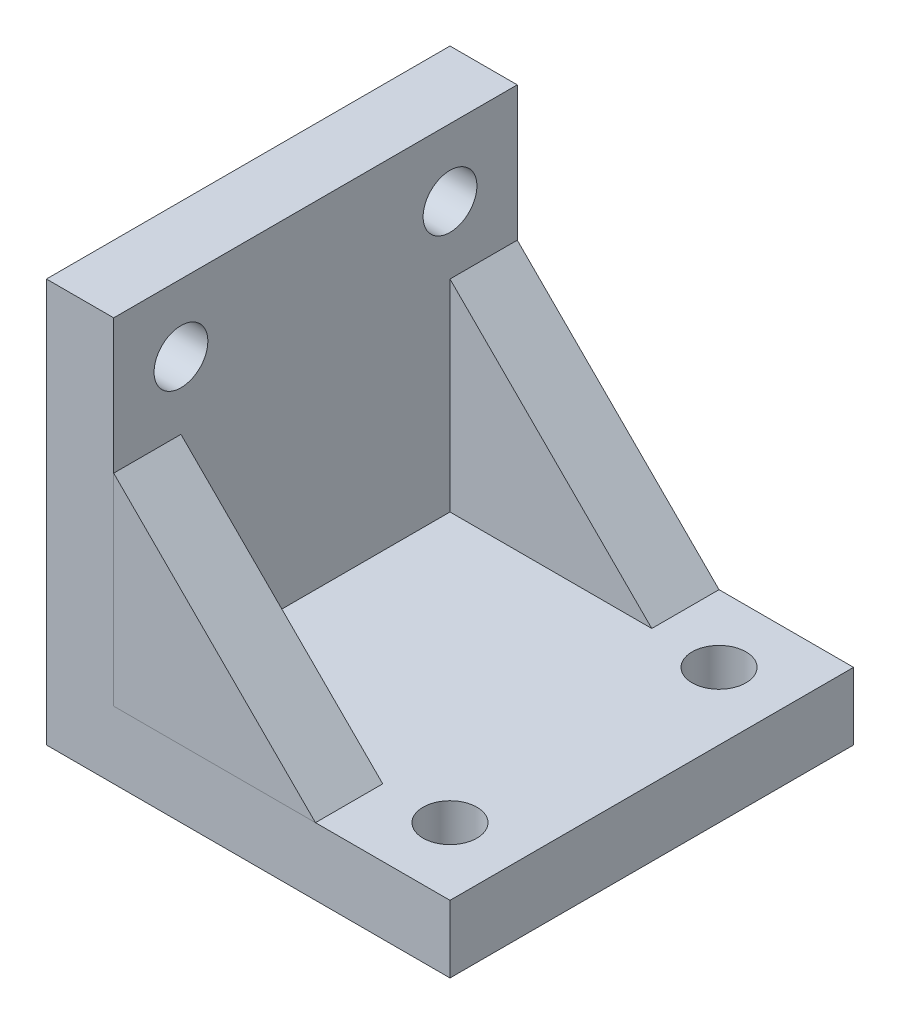
ISO-10303-21;
HEADER;
FILE_DESCRIPTION(('STEP AP214'),'2;1');
FILE_NAME('part.step','',(''),(''),'','','');
FILE_SCHEMA(('AUTOMOTIVE_DESIGN { 1 0 10303 214 1 1 1 1 }'));
ENDSEC;
DATA;
#1=APPLICATION_CONTEXT('core data for automotive mechanical design processes');
#2=APPLICATION_PROTOCOL_DEFINITION('international standard','automotive_design',2000,#1);
#3=PRODUCT_CONTEXT('',#1,'mechanical');
#4=PRODUCT('Part','Part','',(#3));
#5=PRODUCT_RELATED_PRODUCT_CATEGORY('part','',(#4));
#6=PRODUCT_DEFINITION_FORMATION('','',#4);
#7=PRODUCT_DEFINITION_CONTEXT('part definition',#1,'design');
#8=PRODUCT_DEFINITION('design','',#6,#7);
#9=PRODUCT_DEFINITION_SHAPE('','',#8);
#10=(LENGTH_UNIT() NAMED_UNIT(*) SI_UNIT(.MILLI.,.METRE.));
#11=(NAMED_UNIT(*) PLANE_ANGLE_UNIT() SI_UNIT($,.RADIAN.));
#12=(NAMED_UNIT(*) SI_UNIT($,.STERADIAN.) SOLID_ANGLE_UNIT());
#13=UNCERTAINTY_MEASURE_WITH_UNIT(LENGTH_MEASURE(1.E-05),#10,'distance_accuracy_value','');
#14=(GEOMETRIC_REPRESENTATION_CONTEXT(3) GLOBAL_UNCERTAINTY_ASSIGNED_CONTEXT((#13)) GLOBAL_UNIT_ASSIGNED_CONTEXT((#10,
#11,#12)) REPRESENTATION_CONTEXT('',''));
#15=CARTESIAN_POINT('',(0.,0.,0.));
#16=DIRECTION('',(0.,0.,1.));
#17=DIRECTION('',(1.,0.,0.));
#18=AXIS2_PLACEMENT_3D('',#15,#16,#17);
#19=CARTESIAN_POINT('',(5.00000000000001,5.,10.));
#20=DIRECTION('',(0.,-1.,0.));
#21=DIRECTION('',(0.,0.,-1.));
#22=AXIS2_PLACEMENT_3D('',#19,#20,#21);
#23=PLANE('',#22);
#24=DIRECTION('',(1.,0.,0.));
#25=VECTOR('',#24,1.);
#26=CARTESIAN_POINT('',(5.00000000000001,5.,15.));
#27=LINE('',#26,#25);
#28=CARTESIAN_POINT('',(-9.99999999999999,5.,15.));
#29=VERTEX_POINT('',#28);
#30=CARTESIAN_POINT('',(5.00000000000001,5.,15.));
#31=VERTEX_POINT('',#30);
#32=EDGE_CURVE('E94',#29,#31,#27,.T.);
#33=ORIENTED_EDGE('',*,*,#32,.F.);
#34=DIRECTION('',(0.,0.,1.));
#35=VECTOR('',#34,1.);
#36=CARTESIAN_POINT('',(-9.99999999999999,5.,10.));
#37=LINE('',#36,#35);
#38=CARTESIAN_POINT('',(-9.99999999999999,5.,10.));
#39=VERTEX_POINT('',#38);
#40=EDGE_CURVE('E12',#39,#29,#37,.T.);
#41=ORIENTED_EDGE('',*,*,#40,.F.);
#42=DIRECTION('',(1.,0.,0.));
#43=VECTOR('',#42,1.);
#44=CARTESIAN_POINT('',(5.00000000000001,5.,10.));
#45=LINE('',#44,#43);
#46=CARTESIAN_POINT('',(5.00000000000001,5.,10.));
#47=VERTEX_POINT('',#46);
#48=EDGE_CURVE('E86',#39,#47,#45,.T.);
#49=ORIENTED_EDGE('',*,*,#48,.T.);
#50=DIRECTION('',(0.,0.,1.));
#51=VECTOR('',#50,1.);
#52=CARTESIAN_POINT('',(5.00000000000001,5.,10.));
#53=LINE('',#52,#51);
#54=EDGE_CURVE('E45',#47,#31,#53,.T.);
#55=ORIENTED_EDGE('',*,*,#54,.T.);
#56=EDGE_LOOP('',(#33,#41,#49,#55));
#57=FACE_BOUND('',#56,.T.);
#58=ADVANCED_FACE('F42',(#57),#23,.T.);
#59=CARTESIAN_POINT('',(-9.99999999999999,5.,10.));
#60=DIRECTION('',(-1.,0.,0.));
#61=DIRECTION('',(0.,-1.,0.));
#62=AXIS2_PLACEMENT_3D('',#59,#60,#61);
#63=PLANE('',#62);
#64=DIRECTION('',(0.,-1.,0.));
#65=VECTOR('',#64,1.);
#66=CARTESIAN_POINT('',(-9.99999999999999,5.,15.));
#67=LINE('',#66,#65);
#68=CARTESIAN_POINT('',(-9.99999999999999,20.,15.));
#69=VERTEX_POINT('',#68);
#70=EDGE_CURVE('E88',#69,#29,#67,.T.);
#71=ORIENTED_EDGE('',*,*,#70,.F.);
#72=DIRECTION('',(0.,0.,1.));
#73=VECTOR('',#72,1.);
#74=CARTESIAN_POINT('',(-9.99999999999999,20.,10.));
#75=LINE('',#74,#73);
#76=CARTESIAN_POINT('',(-9.99999999999999,20.,10.));
#77=VERTEX_POINT('',#76);
#78=EDGE_CURVE('E51',#77,#69,#75,.T.);
#79=ORIENTED_EDGE('',*,*,#78,.F.);
#80=DIRECTION('',(0.,-1.,0.));
#81=VECTOR('',#80,1.);
#82=CARTESIAN_POINT('',(-9.99999999999999,5.,10.));
#83=LINE('',#82,#81);
#84=EDGE_CURVE('E83',#77,#39,#83,.T.);
#85=ORIENTED_EDGE('',*,*,#84,.T.);
#86=ORIENTED_EDGE('',*,*,#40,.T.);
#87=EDGE_LOOP('',(#71,#79,#85,#86));
#88=FACE_BOUND('',#87,.T.);
#89=ADVANCED_FACE('F98',(#88),#63,.T.);
#90=CARTESIAN_POINT('',(-9.99999999999999,20.,10.));
#91=DIRECTION('',(0.707106781186548,0.707106781186548,0.));
#92=DIRECTION('',(-0.707106781186548,0.707106781186548,0.));
#93=AXIS2_PLACEMENT_3D('',#90,#91,#92);
#94=PLANE('',#93);
#95=DIRECTION('',(-0.707106781186547,0.707106781186547,0.));
#96=VECTOR('',#95,1.);
#97=CARTESIAN_POINT('',(-9.99999999999999,20.,15.));
#98=LINE('',#97,#96);
#99=EDGE_CURVE('E81',#31,#69,#98,.T.);
#100=ORIENTED_EDGE('',*,*,#99,.F.);
#101=ORIENTED_EDGE('',*,*,#54,.F.);
#102=DIRECTION('',(-0.707106781186547,0.707106781186547,0.));
#103=VECTOR('',#102,1.);
#104=CARTESIAN_POINT('',(-9.99999999999999,20.,10.));
#105=LINE('',#104,#103);
#106=EDGE_CURVE('E79',#47,#77,#105,.T.);
#107=ORIENTED_EDGE('',*,*,#106,.T.);
#108=ORIENTED_EDGE('',*,*,#78,.T.);
#109=EDGE_LOOP('',(#100,#101,#107,#108));
#110=FACE_BOUND('',#109,.T.);
#111=ADVANCED_FACE('F78',(#110),#94,.T.);
#112=CARTESIAN_POINT('',(0.,0.,10.));
#113=DIRECTION('',(0.,0.,-1.));
#114=DIRECTION('',(-1.,0.,0.));
#115=AXIS2_PLACEMENT_3D('',#112,#113,#114);
#116=PLANE('',#115);
#117=ORIENTED_EDGE('',*,*,#48,.F.);
#118=ORIENTED_EDGE('',*,*,#84,.F.);
#119=ORIENTED_EDGE('',*,*,#106,.F.);
#120=EDGE_LOOP('',(#117,#118,#119));
#121=FACE_BOUND('',#120,.T.);
#122=ADVANCED_FACE('F85',(#121),#116,.T.);
#123=CARTESIAN_POINT('',(0.,0.,15.));
#124=DIRECTION('',(0.,0.,-1.));
#125=DIRECTION('',(-1.,0.,0.));
#126=AXIS2_PLACEMENT_3D('',#123,#124,#125);
#127=PLANE('',#126);
#128=ORIENTED_EDGE('',*,*,#32,.T.);
#129=ORIENTED_EDGE('',*,*,#99,.T.);
#130=ORIENTED_EDGE('',*,*,#70,.T.);
#131=EDGE_LOOP('',(#128,#129,#130));
#132=FACE_BOUND('',#131,.T.);
#133=ADVANCED_FACE('F97',(#132),#127,.F.);
#134=CLOSED_SHELL('',(#58,#89,#111,#122,#133));
#135=MANIFOLD_SOLID_BREP('B2',#134);
#136=CARTESIAN_POINT('',(0.,5.,0.));
#137=DIRECTION('',(0.,-1.,0.));
#138=DIRECTION('',(0.,0.,-1.));
#139=AXIS2_PLACEMENT_3D('',#136,#137,#138);
#140=PLANE('',#139);
#141=CARTESIAN_POINT('',(10.,5.,10.));
#142=DIRECTION('',(0.,1.,0.));
#143=DIRECTION('',(0.,0.,1.));
#144=AXIS2_PLACEMENT_3D('',#141,#142,#143);
#145=CIRCLE('',#144,2.);
#146=CARTESIAN_POINT('',(10.,5.,12.));
#147=VERTEX_POINT('',#146);
#148=EDGE_CURVE('E306',#147,#147,#145,.T.);
#149=ORIENTED_EDGE('',*,*,#148,.F.);
#150=EDGE_LOOP('',(#149));
#151=FACE_BOUND('',#150,.T.);
#152=CARTESIAN_POINT('',(10.,5.,-10.));
#153=DIRECTION('',(0.,1.,0.));
#154=DIRECTION('',(0.,0.,1.));
#155=AXIS2_PLACEMENT_3D('',#152,#153,#154);
#156=CIRCLE('',#155,2.);
#157=CARTESIAN_POINT('',(10.,5.,-8.));
#158=VERTEX_POINT('',#157);
#159=EDGE_CURVE('E300',#158,#158,#156,.T.);
#160=ORIENTED_EDGE('',*,*,#159,.F.);
#161=EDGE_LOOP('',(#160));
#162=FACE_BOUND('',#161,.T.);
#163=DIRECTION('',(0.,0.,-1.));
#164=VECTOR('',#163,1.);
#165=CARTESIAN_POINT('',(5.00000000000001,5.,-10.));
#166=LINE('',#165,#164);
#167=CARTESIAN_POINT('',(5.00000000000001,5.,-10.));
#168=VERTEX_POINT('',#167);
#169=CARTESIAN_POINT('',(5.00000000000001,5.,-15.));
#170=VERTEX_POINT('',#169);
#171=EDGE_CURVE('E239',#168,#170,#166,.T.);
#172=ORIENTED_EDGE('',*,*,#171,.F.);
#173=DIRECTION('',(1.,0.,0.));
#174=VECTOR('',#173,1.);
#175=CARTESIAN_POINT('',(5.00000000000001,5.,-10.));
#176=LINE('',#175,#174);
#177=CARTESIAN_POINT('',(-9.99999999999999,5.,-10.));
#178=VERTEX_POINT('',#177);
#179=EDGE_CURVE('E254',#178,#168,#176,.T.);
#180=ORIENTED_EDGE('',*,*,#179,.F.);
#181=DIRECTION('',(0.,0.,-1.));
#182=VECTOR('',#181,1.);
#183=CARTESIAN_POINT('',(-9.99999999999999,5.,-15.));
#184=LINE('',#183,#182);
#185=CARTESIAN_POINT('',(-9.99999999999999,5.,15.));
#186=VERTEX_POINT('',#185);
#187=EDGE_CURVE('E154',#186,#178,#184,.T.);
#188=ORIENTED_EDGE('',*,*,#187,.F.);
#189=DIRECTION('',(1.,0.,0.));
#190=VECTOR('',#189,1.);
#191=CARTESIAN_POINT('',(-15.,5.,15.));
#192=LINE('',#191,#190);
#193=CARTESIAN_POINT('',(15.,5.,15.));
#194=VERTEX_POINT('',#193);
#195=EDGE_CURVE('E159',#186,#194,#192,.T.);
#196=ORIENTED_EDGE('',*,*,#195,.T.);
#197=DIRECTION('',(0.,0.,-1.));
#198=VECTOR('',#197,1.);
#199=CARTESIAN_POINT('',(15.,5.,15.));
#200=LINE('',#199,#198);
#201=CARTESIAN_POINT('',(15.,5.,-15.));
#202=VERTEX_POINT('',#201);
#203=EDGE_CURVE('E190',#194,#202,#200,.T.);
#204=ORIENTED_EDGE('',*,*,#203,.T.);
#205=DIRECTION('',(-1.,0.,0.));
#206=VECTOR('',#205,1.);
#207=CARTESIAN_POINT('',(-15.,5.,-15.));
#208=LINE('',#207,#206);
#209=EDGE_CURVE('E241',#202,#170,#208,.T.);
#210=ORIENTED_EDGE('',*,*,#209,.T.);
#211=EDGE_LOOP('',(#172,#180,#188,#196,#204,#210));
#212=FACE_BOUND('',#211,.T.);
#213=ADVANCED_FACE('F139',(#151,#162,#212),#140,.F.);
#214=CARTESIAN_POINT('',(-9.99999999999999,30.,-15.));
#215=DIRECTION('',(-1.,0.,0.));
#216=DIRECTION('',(0.,0.,1.));
#217=AXIS2_PLACEMENT_3D('',#214,#215,#216);
#218=PLANE('',#217);
#219=CARTESIAN_POINT('',(-9.99999999999999,25.,-10.));
#220=DIRECTION('',(1.,0.,0.));
#221=DIRECTION('',(0.,0.,-1.));
#222=AXIS2_PLACEMENT_3D('',#219,#220,#221);
#223=CIRCLE('',#222,2.);
#224=CARTESIAN_POINT('',(-9.99999999999999,25.,-12.));
#225=VERTEX_POINT('',#224);
#226=EDGE_CURVE('E294',#225,#225,#223,.T.);
#227=ORIENTED_EDGE('',*,*,#226,.F.);
#228=EDGE_LOOP('',(#227));
#229=FACE_BOUND('',#228,.T.);
#230=CARTESIAN_POINT('',(-9.99999999999999,25.,10.));
#231=DIRECTION('',(1.,0.,0.));
#232=DIRECTION('',(0.,0.,-1.));
#233=AXIS2_PLACEMENT_3D('',#230,#231,#232);
#234=CIRCLE('',#233,2.);
#235=CARTESIAN_POINT('',(-9.99999999999999,25.,8.));
#236=VERTEX_POINT('',#235);
#237=EDGE_CURVE('E288',#236,#236,#234,.T.);
#238=ORIENTED_EDGE('',*,*,#237,.F.);
#239=EDGE_LOOP('',(#238));
#240=FACE_BOUND('',#239,.T.);
#241=DIRECTION('',(0.,0.,-1.));
#242=VECTOR('',#241,1.);
#243=CARTESIAN_POINT('',(-9.99999999999999,20.,-10.));
#244=LINE('',#243,#242);
#245=CARTESIAN_POINT('',(-9.99999999999999,20.,-10.));
#246=VERTEX_POINT('',#245);
#247=CARTESIAN_POINT('',(-9.99999999999999,20.,-15.));
#248=VERTEX_POINT('',#247);
#249=EDGE_CURVE('E262',#246,#248,#244,.T.);
#250=ORIENTED_EDGE('',*,*,#249,.T.);
#251=DIRECTION('',(0.,-1.,0.));
#252=VECTOR('',#251,1.);
#253=CARTESIAN_POINT('',(-9.99999999999999,30.,-15.));
#254=LINE('',#253,#252);
#255=CARTESIAN_POINT('',(-9.99999999999999,30.,-15.));
#256=VERTEX_POINT('',#255);
#257=EDGE_CURVE('E204',#256,#248,#254,.T.);
#258=ORIENTED_EDGE('',*,*,#257,.F.);
#259=DIRECTION('',(0.,0.,-1.));
#260=VECTOR('',#259,1.);
#261=CARTESIAN_POINT('',(-9.99999999999999,30.,-15.));
#262=LINE('',#261,#260);
#263=CARTESIAN_POINT('',(-9.99999999999999,30.,15.));
#264=VERTEX_POINT('',#263);
#265=EDGE_CURVE('E231',#264,#256,#262,.T.);
#266=ORIENTED_EDGE('',*,*,#265,.F.);
#267=DIRECTION('',(0.,-1.,0.));
#268=VECTOR('',#267,1.);
#269=CARTESIAN_POINT('',(-9.99999999999999,30.,15.));
#270=LINE('',#269,#268);
#271=EDGE_CURVE('E200',#264,#186,#270,.T.);
#272=ORIENTED_EDGE('',*,*,#271,.T.);
#273=ORIENTED_EDGE('',*,*,#187,.T.);
#274=DIRECTION('',(0.,-1.,0.));
#275=VECTOR('',#274,1.);
#276=CARTESIAN_POINT('',(-9.99999999999999,5.,-10.));
#277=LINE('',#276,#275);
#278=EDGE_CURVE('E264',#246,#178,#277,.T.);
#279=ORIENTED_EDGE('',*,*,#278,.F.);
#280=EDGE_LOOP('',(#250,#258,#266,#272,#273,#279));
#281=FACE_BOUND('',#280,.T.);
#282=ADVANCED_FACE('F271',(#229,#240,#281),#218,.F.);
#283=CARTESIAN_POINT('',(15.,5.,15.));
#284=DIRECTION('',(-1.,0.,0.));
#285=DIRECTION('',(0.,0.,1.));
#286=AXIS2_PLACEMENT_3D('',#283,#284,#285);
#287=PLANE('',#286);
#288=DIRECTION('',(0.,0.,-1.));
#289=VECTOR('',#288,1.);
#290=CARTESIAN_POINT('',(15.,0.,15.));
#291=LINE('',#290,#289);
#292=CARTESIAN_POINT('',(15.,0.,15.));
#293=VERTEX_POINT('',#292);
#294=CARTESIAN_POINT('',(15.,0.,-15.));
#295=VERTEX_POINT('',#294);
#296=EDGE_CURVE('E196',#293,#295,#291,.T.);
#297=ORIENTED_EDGE('',*,*,#296,.T.);
#298=DIRECTION('',(0.,-1.,0.));
#299=VECTOR('',#298,1.);
#300=CARTESIAN_POINT('',(15.,5.,-15.));
#301=LINE('',#300,#299);
#302=EDGE_CURVE('E40',#202,#295,#301,.T.);
#303=ORIENTED_EDGE('',*,*,#302,.F.);
#304=ORIENTED_EDGE('',*,*,#203,.F.);
#305=DIRECTION('',(0.,-1.,0.));
#306=VECTOR('',#305,1.);
#307=CARTESIAN_POINT('',(15.,5.,15.));
#308=LINE('',#307,#306);
#309=EDGE_CURVE('E182',#194,#293,#308,.T.);
#310=ORIENTED_EDGE('',*,*,#309,.T.);
#311=EDGE_LOOP('',(#297,#303,#304,#310));
#312=FACE_BOUND('',#311,.T.);
#313=ADVANCED_FACE('F141',(#312),#287,.F.);
#314=CARTESIAN_POINT('',(-15.,5.,-15.));
#315=DIRECTION('',(0.,0.,1.));
#316=DIRECTION('',(1.,0.,0.));
#317=AXIS2_PLACEMENT_3D('',#314,#315,#316);
#318=PLANE('',#317);
#319=DIRECTION('',(-0.707106781186547,0.707106781186547,0.));
#320=VECTOR('',#319,1.);
#321=CARTESIAN_POINT('',(-9.99999999999999,20.,-15.));
#322=LINE('',#321,#320);
#323=EDGE_CURVE('E250',#170,#248,#322,.T.);
#324=ORIENTED_EDGE('',*,*,#323,.F.);
#325=ORIENTED_EDGE('',*,*,#209,.F.);
#326=ORIENTED_EDGE('',*,*,#302,.T.);
#327=DIRECTION('',(-1.,0.,0.));
#328=VECTOR('',#327,1.);
#329=CARTESIAN_POINT('',(-15.,0.,-15.));
#330=LINE('',#329,#328);
#331=CARTESIAN_POINT('',(-15.,0.,-15.));
#332=VERTEX_POINT('',#331);
#333=EDGE_CURVE('E199',#295,#332,#330,.T.);
#334=ORIENTED_EDGE('',*,*,#333,.T.);
#335=DIRECTION('',(0.,-1.,0.));
#336=VECTOR('',#335,1.);
#337=CARTESIAN_POINT('',(-15.,5.,-15.));
#338=LINE('',#337,#336);
#339=CARTESIAN_POINT('',(-15.,30.,-15.));
#340=VERTEX_POINT('',#339);
#341=EDGE_CURVE('E147',#340,#332,#338,.T.);
#342=ORIENTED_EDGE('',*,*,#341,.F.);
#343=DIRECTION('',(-1.,0.,0.));
#344=VECTOR('',#343,1.);
#345=CARTESIAN_POINT('',(-15.,30.,-15.));
#346=LINE('',#345,#344);
#347=EDGE_CURVE('E224',#256,#340,#346,.T.);
#348=ORIENTED_EDGE('',*,*,#347,.F.);
#349=ORIENTED_EDGE('',*,*,#257,.T.);
#350=EDGE_LOOP('',(#324,#325,#326,#334,#342,#348,#349));
#351=FACE_BOUND('',#350,.T.);
#352=ADVANCED_FACE('F221',(#351),#318,.F.);
#353=CARTESIAN_POINT('',(-15.,5.,15.));
#354=DIRECTION('',(1.,0.,0.));
#355=DIRECTION('',(0.,0.,-1.));
#356=AXIS2_PLACEMENT_3D('',#353,#354,#355);
#357=PLANE('',#356);
#358=CARTESIAN_POINT('',(-15.,25.,-10.));
#359=DIRECTION('',(1.,0.,0.));
#360=DIRECTION('',(0.,0.,-1.));
#361=AXIS2_PLACEMENT_3D('',#358,#359,#360);
#362=CIRCLE('',#361,2.);
#363=CARTESIAN_POINT('',(-15.,25.,-12.));
#364=VERTEX_POINT('',#363);
#365=EDGE_CURVE('E291',#364,#364,#362,.T.);
#366=ORIENTED_EDGE('',*,*,#365,.T.);
#367=EDGE_LOOP('',(#366));
#368=FACE_BOUND('',#367,.T.);
#369=CARTESIAN_POINT('',(-15.,25.,10.));
#370=DIRECTION('',(1.,0.,0.));
#371=DIRECTION('',(0.,0.,-1.));
#372=AXIS2_PLACEMENT_3D('',#369,#370,#371);
#373=CIRCLE('',#372,2.);
#374=CARTESIAN_POINT('',(-15.,25.,8.));
#375=VERTEX_POINT('',#374);
#376=EDGE_CURVE('E255',#375,#375,#373,.T.);
#377=ORIENTED_EDGE('',*,*,#376,.T.);
#378=EDGE_LOOP('',(#377));
#379=FACE_BOUND('',#378,.T.);
#380=DIRECTION('',(0.,0.,1.));
#381=VECTOR('',#380,1.);
#382=CARTESIAN_POINT('',(-15.,0.,15.));
#383=LINE('',#382,#381);
#384=CARTESIAN_POINT('',(-15.,0.,15.));
#385=VERTEX_POINT('',#384);
#386=EDGE_CURVE('E191',#332,#385,#383,.T.);
#387=ORIENTED_EDGE('',*,*,#386,.T.);
#388=DIRECTION('',(0.,-1.,0.));
#389=VECTOR('',#388,1.);
#390=CARTESIAN_POINT('',(-15.,5.,15.));
#391=LINE('',#390,#389);
#392=CARTESIAN_POINT('',(-15.,30.,15.));
#393=VERTEX_POINT('',#392);
#394=EDGE_CURVE('E186',#393,#385,#391,.T.);
#395=ORIENTED_EDGE('',*,*,#394,.F.);
#396=DIRECTION('',(0.,0.,1.));
#397=VECTOR('',#396,1.);
#398=CARTESIAN_POINT('',(-15.,30.,-15.));
#399=LINE('',#398,#397);
#400=EDGE_CURVE('E216',#340,#393,#399,.T.);
#401=ORIENTED_EDGE('',*,*,#400,.F.);
#402=ORIENTED_EDGE('',*,*,#341,.T.);
#403=EDGE_LOOP('',(#387,#395,#401,#402));
#404=FACE_BOUND('',#403,.T.);
#405=ADVANCED_FACE('F214',(#368,#379,#404),#357,.F.);
#406=CARTESIAN_POINT('',(-15.,5.,15.));
#407=DIRECTION('',(0.,0.,-1.));
#408=DIRECTION('',(-1.,0.,0.));
#409=AXIS2_PLACEMENT_3D('',#406,#407,#408);
#410=PLANE('',#409);
#411=DIRECTION('',(1.,0.,0.));
#412=VECTOR('',#411,1.);
#413=CARTESIAN_POINT('',(-15.,0.,15.));
#414=LINE('',#413,#412);
#415=EDGE_CURVE('E179',#385,#293,#414,.T.);
#416=ORIENTED_EDGE('',*,*,#415,.T.);
#417=ORIENTED_EDGE('',*,*,#309,.F.);
#418=ORIENTED_EDGE('',*,*,#195,.F.);
#419=ORIENTED_EDGE('',*,*,#271,.F.);
#420=DIRECTION('',(1.,0.,0.));
#421=VECTOR('',#420,1.);
#422=CARTESIAN_POINT('',(-15.,30.,15.));
#423=LINE('',#422,#421);
#424=EDGE_CURVE('E235',#393,#264,#423,.T.);
#425=ORIENTED_EDGE('',*,*,#424,.F.);
#426=ORIENTED_EDGE('',*,*,#394,.T.);
#427=EDGE_LOOP('',(#416,#417,#418,#419,#425,#426));
#428=FACE_BOUND('',#427,.T.);
#429=ADVANCED_FACE('F181',(#428),#410,.F.);
#430=CARTESIAN_POINT('',(0.,0.,0.));
#431=DIRECTION('',(0.,-1.,0.));
#432=DIRECTION('',(0.,0.,-1.));
#433=AXIS2_PLACEMENT_3D('',#430,#431,#432);
#434=PLANE('',#433);
#435=CARTESIAN_POINT('',(10.,0.,10.));
#436=DIRECTION('',(0.,1.,0.));
#437=DIRECTION('',(0.,0.,1.));
#438=AXIS2_PLACEMENT_3D('',#435,#436,#437);
#439=CIRCLE('',#438,2.);
#440=CARTESIAN_POINT('',(10.,0.,12.));
#441=VERTEX_POINT('',#440);
#442=EDGE_CURVE('E303',#441,#441,#439,.T.);
#443=ORIENTED_EDGE('',*,*,#442,.T.);
#444=EDGE_LOOP('',(#443));
#445=FACE_BOUND('',#444,.T.);
#446=CARTESIAN_POINT('',(10.,0.,-10.));
#447=DIRECTION('',(0.,1.,0.));
#448=DIRECTION('',(0.,0.,1.));
#449=AXIS2_PLACEMENT_3D('',#446,#447,#448);
#450=CIRCLE('',#449,2.);
#451=CARTESIAN_POINT('',(10.,0.,-8.));
#452=VERTEX_POINT('',#451);
#453=EDGE_CURVE('E297',#452,#452,#450,.T.);
#454=ORIENTED_EDGE('',*,*,#453,.T.);
#455=EDGE_LOOP('',(#454));
#456=FACE_BOUND('',#455,.T.);
#457=ORIENTED_EDGE('',*,*,#296,.F.);
#458=ORIENTED_EDGE('',*,*,#415,.F.);
#459=ORIENTED_EDGE('',*,*,#386,.F.);
#460=ORIENTED_EDGE('',*,*,#333,.F.);
#461=EDGE_LOOP('',(#457,#458,#459,#460));
#462=FACE_BOUND('',#461,.T.);
#463=ADVANCED_FACE('F198',(#445,#456,#462),#434,.T.);
#464=CARTESIAN_POINT('',(0.,30.,0.));
#465=DIRECTION('',(0.,1.,0.));
#466=DIRECTION('',(0.,0.,1.));
#467=AXIS2_PLACEMENT_3D('',#464,#465,#466);
#468=PLANE('',#467);
#469=ORIENTED_EDGE('',*,*,#400,.T.);
#470=ORIENTED_EDGE('',*,*,#424,.T.);
#471=ORIENTED_EDGE('',*,*,#265,.T.);
#472=ORIENTED_EDGE('',*,*,#347,.T.);
#473=EDGE_LOOP('',(#469,#470,#471,#472));
#474=FACE_BOUND('',#473,.T.);
#475=ADVANCED_FACE('F227',(#474),#468,.T.);
#476=CARTESIAN_POINT('',(-9.99999999999999,20.,-10.));
#477=DIRECTION('',(-0.707106781186548,-0.707106781186548,0.));
#478=DIRECTION('',(0.707106781186548,-0.707106781186548,0.));
#479=AXIS2_PLACEMENT_3D('',#476,#477,#478);
#480=PLANE('',#479);
#481=ORIENTED_EDGE('',*,*,#323,.T.);
#482=ORIENTED_EDGE('',*,*,#249,.F.);
#483=DIRECTION('',(-0.707106781186547,0.707106781186547,0.));
#484=VECTOR('',#483,1.);
#485=CARTESIAN_POINT('',(-9.99999999999999,20.,-10.));
#486=LINE('',#485,#484);
#487=EDGE_CURVE('E260',#168,#246,#486,.T.);
#488=ORIENTED_EDGE('',*,*,#487,.F.);
#489=ORIENTED_EDGE('',*,*,#171,.T.);
#490=EDGE_LOOP('',(#481,#482,#488,#489));
#491=FACE_BOUND('',#490,.T.);
#492=ADVANCED_FACE('F258',(#491),#480,.F.);
#493=CARTESIAN_POINT('',(0.,0.,-10.));
#494=DIRECTION('',(0.,0.,-1.));
#495=DIRECTION('',(-1.,0.,0.));
#496=AXIS2_PLACEMENT_3D('',#493,#494,#495);
#497=PLANE('',#496);
#498=ORIENTED_EDGE('',*,*,#179,.T.);
#499=ORIENTED_EDGE('',*,*,#487,.T.);
#500=ORIENTED_EDGE('',*,*,#278,.T.);
#501=EDGE_LOOP('',(#498,#499,#500));
#502=FACE_BOUND('',#501,.T.);
#503=ADVANCED_FACE('F283',(#502),#497,.F.);
#504=CARTESIAN_POINT('',(-15.,25.,10.));
#505=DIRECTION('',(1.,0.,0.));
#506=DIRECTION('',(0.,0.,-1.));
#507=AXIS2_PLACEMENT_3D('',#504,#505,#506);
#508=CYLINDRICAL_SURFACE('',#507,2.);
#509=ORIENTED_EDGE('',*,*,#376,.F.);
#510=EDGE_LOOP('',(#509));
#511=FACE_BOUND('',#510,.T.);
#512=ORIENTED_EDGE('',*,*,#237,.T.);
#513=EDGE_LOOP('',(#512));
#514=FACE_BOUND('',#513,.T.);
#515=ADVANCED_FACE('F333',(#511,#514),#508,.F.);
#516=CARTESIAN_POINT('',(-15.,25.,-10.));
#517=DIRECTION('',(1.,0.,0.));
#518=DIRECTION('',(0.,0.,-1.));
#519=AXIS2_PLACEMENT_3D('',#516,#517,#518);
#520=CYLINDRICAL_SURFACE('',#519,2.);
#521=ORIENTED_EDGE('',*,*,#365,.F.);
#522=EDGE_LOOP('',(#521));
#523=FACE_BOUND('',#522,.T.);
#524=ORIENTED_EDGE('',*,*,#226,.T.);
#525=EDGE_LOOP('',(#524));
#526=FACE_BOUND('',#525,.T.);
#527=ADVANCED_FACE('F327',(#523,#526),#520,.F.);
#528=CARTESIAN_POINT('',(10.,0.,-10.));
#529=DIRECTION('',(0.,1.,0.));
#530=DIRECTION('',(0.,0.,1.));
#531=AXIS2_PLACEMENT_3D('',#528,#529,#530);
#532=CYLINDRICAL_SURFACE('',#531,2.);
#533=ORIENTED_EDGE('',*,*,#453,.F.);
#534=EDGE_LOOP('',(#533));
#535=FACE_BOUND('',#534,.T.);
#536=ORIENTED_EDGE('',*,*,#159,.T.);
#537=EDGE_LOOP('',(#536));
#538=FACE_BOUND('',#537,.T.);
#539=ADVANCED_FACE('F317',(#535,#538),#532,.F.);
#540=CARTESIAN_POINT('',(10.,0.,10.));
#541=DIRECTION('',(0.,1.,0.));
#542=DIRECTION('',(0.,0.,1.));
#543=AXIS2_PLACEMENT_3D('',#540,#541,#542);
#544=CYLINDRICAL_SURFACE('',#543,2.);
#545=ORIENTED_EDGE('',*,*,#442,.F.);
#546=EDGE_LOOP('',(#545));
#547=FACE_BOUND('',#546,.T.);
#548=ORIENTED_EDGE('',*,*,#148,.T.);
#549=EDGE_LOOP('',(#548));
#550=FACE_BOUND('',#549,.T.);
#551=ADVANCED_FACE('F314',(#547,#550),#544,.F.);
#552=CLOSED_SHELL('',(#213,#282,#313,#352,#405,#429,#463,#475,#492,#503,#515,#527,#539,#551));
#553=MANIFOLD_SOLID_BREP('B6',#552);
#554=ADVANCED_BREP_SHAPE_REPRESENTATION('',(#18,#135,#553),#14);
#555=SHAPE_DEFINITION_REPRESENTATION(#9,#554);
ENDSEC;
END-ISO-10303-21;
